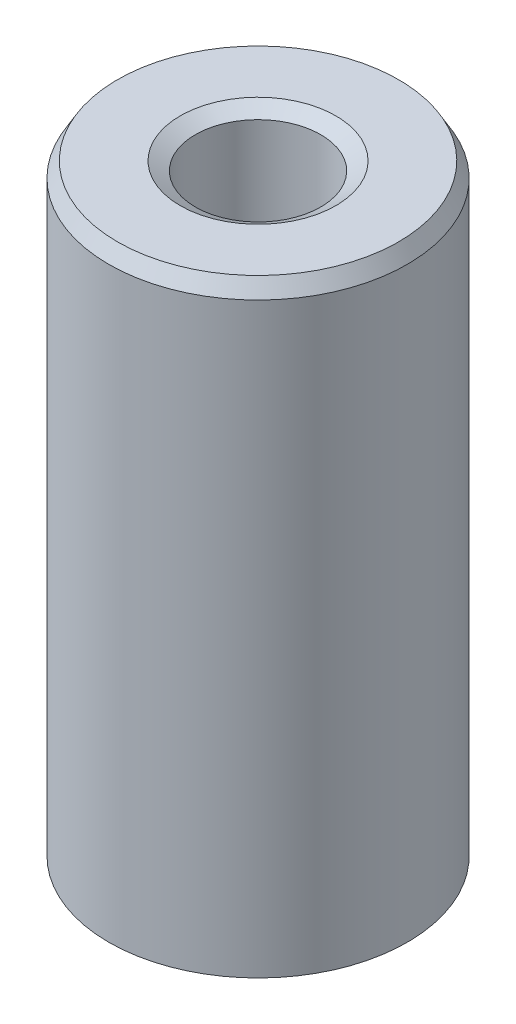
ISO-10303-21;
HEADER;
FILE_DESCRIPTION(('STEP AP214'),'2;1');
FILE_NAME('part.step','',(''),(''),'','','');
FILE_SCHEMA(('AUTOMOTIVE_DESIGN { 1 0 10303 214 1 1 1 1 }'));
ENDSEC;
DATA;
#1=APPLICATION_CONTEXT('core data for automotive mechanical design processes');
#2=APPLICATION_PROTOCOL_DEFINITION('international standard','automotive_design',2000,#1);
#3=PRODUCT_CONTEXT('',#1,'mechanical');
#4=PRODUCT('Part','Part','',(#3));
#5=PRODUCT_RELATED_PRODUCT_CATEGORY('part','',(#4));
#6=PRODUCT_DEFINITION_FORMATION('','',#4);
#7=PRODUCT_DEFINITION_CONTEXT('part definition',#1,'design');
#8=PRODUCT_DEFINITION('design','',#6,#7);
#9=PRODUCT_DEFINITION_SHAPE('','',#8);
#10=(LENGTH_UNIT() NAMED_UNIT(*) SI_UNIT(.MILLI.,.METRE.));
#11=(NAMED_UNIT(*) PLANE_ANGLE_UNIT() SI_UNIT($,.RADIAN.));
#12=(NAMED_UNIT(*) SI_UNIT($,.STERADIAN.) SOLID_ANGLE_UNIT());
#13=UNCERTAINTY_MEASURE_WITH_UNIT(LENGTH_MEASURE(1.E-05),#10,'distance_accuracy_value','');
#14=(GEOMETRIC_REPRESENTATION_CONTEXT(3) GLOBAL_UNCERTAINTY_ASSIGNED_CONTEXT((#13)) GLOBAL_UNIT_ASSIGNED_CONTEXT((#10,
#11,#12)) REPRESENTATION_CONTEXT('',''));
#15=CARTESIAN_POINT('',(0.,0.,0.));
#16=DIRECTION('',(0.,0.,1.));
#17=DIRECTION('',(1.,0.,0.));
#18=AXIS2_PLACEMENT_3D('',#15,#16,#17);
#19=CARTESIAN_POINT('',(0.,153.48570359672,0.));
#20=DIRECTION('',(0.,-1.,0.));
#21=DIRECTION('',(0.,0.,-1.));
#22=AXIS2_PLACEMENT_3D('',#19,#20,#21);
#23=CYLINDRICAL_SURFACE('',#22,37.5);
#24=CARTESIAN_POINT('',(0.,2.19219811870883,0.));
#25=DIRECTION('',(0.,1.,0.));
#26=DIRECTION('',(0.,0.,1.));
#27=AXIS2_PLACEMENT_3D('',#24,#25,#26);
#28=CIRCLE('',#27,37.5);
#29=CARTESIAN_POINT('',(0.,2.19219811870883,37.5));
#30=VERTEX_POINT('',#29);
#31=EDGE_CURVE('E10',#30,#30,#28,.T.);
#32=ORIENTED_EDGE('',*,*,#31,.T.);
#33=EDGE_LOOP('',(#32));
#34=FACE_BOUND('',#33,.T.);
#35=CARTESIAN_POINT('',(0.,149.68870507486,0.));
#36=DIRECTION('',(0.,1.,0.));
#37=DIRECTION('',(0.,0.,1.));
#38=AXIS2_PLACEMENT_3D('',#35,#36,#37);
#39=CIRCLE('',#38,37.5);
#40=CARTESIAN_POINT('',(0.,149.68870507486,37.5));
#41=VERTEX_POINT('',#40);
#42=EDGE_CURVE('E50',#41,#41,#39,.F.);
#43=ORIENTED_EDGE('',*,*,#42,.T.);
#44=EDGE_LOOP('',(#43));
#45=FACE_BOUND('',#44,.T.);
#46=ADVANCED_FACE('F39',(#34,#45),#23,.T.);
#47=CARTESIAN_POINT('',(0.,153.48570359672,0.));
#48=DIRECTION('',(0.,1.,0.));
#49=DIRECTION('',(0.,0.,1.));
#50=AXIS2_PLACEMENT_3D('',#47,#48,#49);
#51=PLANE('',#50);
#52=CARTESIAN_POINT('',(0.,153.48570359672,0.));
#53=DIRECTION('',(0.,1.,0.));
#54=DIRECTION('',(0.,0.,1.));
#55=AXIS2_PLACEMENT_3D('',#52,#53,#54);
#56=CIRCLE('',#55,19.5526898251311);
#57=CARTESIAN_POINT('',(0.,153.48570359672,19.5526898251311));
#58=VERTEX_POINT('',#57);
#59=EDGE_CURVE('E58',#58,#58,#56,.F.);
#60=ORIENTED_EDGE('',*,*,#59,.T.);
#61=EDGE_LOOP('',(#60));
#62=FACE_BOUND('',#61,.T.);
#63=CARTESIAN_POINT('',(0.,153.48570359672,0.));
#64=DIRECTION('',(0.,1.,0.));
#65=DIRECTION('',(0.,0.,1.));
#66=AXIS2_PLACEMENT_3D('',#63,#64,#65);
#67=CIRCLE('',#66,35.3078018812912);
#68=CARTESIAN_POINT('',(0.,153.48570359672,35.3078018812912));
#69=VERTEX_POINT('',#68);
#70=EDGE_CURVE('E61',#69,#69,#67,.T.);
#71=ORIENTED_EDGE('',*,*,#70,.T.);
#72=EDGE_LOOP('',(#71));
#73=FACE_BOUND('',#72,.T.);
#74=ADVANCED_FACE('F88',(#62,#73),#51,.T.);
#75=CARTESIAN_POINT('',(0.,0.,0.));
#76=DIRECTION('',(0.,1.,0.));
#77=DIRECTION('',(0.,0.,1.));
#78=AXIS2_PLACEMENT_3D('',#75,#76,#77);
#79=PLANE('',#78);
#80=CARTESIAN_POINT('',(0.,0.,0.));
#81=DIRECTION('',(0.,1.,0.));
#82=DIRECTION('',(0.,0.,1.));
#83=AXIS2_PLACEMENT_3D('',#80,#81,#82);
#84=CIRCLE('',#83,17.9478894219793);
#85=CARTESIAN_POINT('',(0.,0.,17.9478894219793));
#86=VERTEX_POINT('',#85);
#87=EDGE_CURVE('E51',#86,#86,#84,.T.);
#88=ORIENTED_EDGE('',*,*,#87,.T.);
#89=EDGE_LOOP('',(#88));
#90=FACE_BOUND('',#89,.T.);
#91=CARTESIAN_POINT('',(0.,0.,0.));
#92=DIRECTION('',(0.,1.,0.));
#93=DIRECTION('',(0.,0.,1.));
#94=AXIS2_PLACEMENT_3D('',#91,#92,#93);
#95=CIRCLE('',#94,33.7030014781394);
#96=CARTESIAN_POINT('',(0.,0.,33.7030014781394));
#97=VERTEX_POINT('',#96);
#98=EDGE_CURVE('E54',#97,#97,#95,.F.);
#99=ORIENTED_EDGE('',*,*,#98,.T.);
#100=EDGE_LOOP('',(#99));
#101=FACE_BOUND('',#100,.T.);
#102=ADVANCED_FACE('F83',(#90,#101),#79,.F.);
#103=CARTESIAN_POINT('',(0.,153.48570359672,0.));
#104=DIRECTION('',(0.,-1.,0.));
#105=DIRECTION('',(0.,0.,-1.));
#106=AXIS2_PLACEMENT_3D('',#103,#104,#105);
#107=CYLINDRICAL_SURFACE('',#106,15.7556913032705);
#108=CARTESIAN_POINT('',(0.,151.293505478012,0.));
#109=DIRECTION('',(0.,1.,0.));
#110=DIRECTION('',(0.,0.,1.));
#111=AXIS2_PLACEMENT_3D('',#108,#109,#110);
#112=CIRCLE('',#111,15.7556913032705);
#113=CARTESIAN_POINT('',(0.,151.293505478012,15.7556913032705));
#114=VERTEX_POINT('',#113);
#115=EDGE_CURVE('E67',#114,#114,#112,.T.);
#116=ORIENTED_EDGE('',*,*,#115,.T.);
#117=EDGE_LOOP('',(#116));
#118=FACE_BOUND('',#117,.T.);
#119=CARTESIAN_POINT('',(0.,3.79699852186058,0.));
#120=DIRECTION('',(0.,1.,0.));
#121=DIRECTION('',(0.,0.,1.));
#122=AXIS2_PLACEMENT_3D('',#119,#120,#121);
#123=CIRCLE('',#122,15.7556913032705);
#124=CARTESIAN_POINT('',(0.,3.79699852186058,15.7556913032705));
#125=VERTEX_POINT('',#124);
#126=EDGE_CURVE('E69',#125,#125,#123,.F.);
#127=ORIENTED_EDGE('',*,*,#126,.T.);
#128=EDGE_LOOP('',(#127));
#129=FACE_BOUND('',#128,.T.);
#130=ADVANCED_FACE('F71',(#118,#129),#107,.F.);
#131=CARTESIAN_POINT('',(0.,151.293505478012,0.));
#132=DIRECTION('',(0.,1.,0.));
#133=DIRECTION('',(0.,0.,1.));
#134=AXIS2_PLACEMENT_3D('',#131,#132,#133);
#135=CONICAL_SURFACE('',#134,15.7556913032705,1.0471975511966);
#136=ORIENTED_EDGE('',*,*,#59,.F.);
#137=EDGE_LOOP('',(#136));
#138=FACE_BOUND('',#137,.T.);
#139=ORIENTED_EDGE('',*,*,#115,.F.);
#140=EDGE_LOOP('',(#139));
#141=FACE_BOUND('',#140,.T.);
#142=ADVANCED_FACE('F77',(#138,#141),#135,.F.);
#143=CARTESIAN_POINT('',(0.,0.,0.));
#144=DIRECTION('',(0.,-1.,0.));
#145=DIRECTION('',(0.,0.,-1.));
#146=AXIS2_PLACEMENT_3D('',#143,#144,#145);
#147=CONICAL_SURFACE('',#146,17.9478894219793,0.523598775598297);
#148=ORIENTED_EDGE('',*,*,#126,.F.);
#149=EDGE_LOOP('',(#148));
#150=FACE_BOUND('',#149,.T.);
#151=ORIENTED_EDGE('',*,*,#87,.F.);
#152=EDGE_LOOP('',(#151));
#153=FACE_BOUND('',#152,.T.);
#154=ADVANCED_FACE('F73',(#150,#153),#147,.F.);
#155=CARTESIAN_POINT('',(0.,2.19219811870883,0.));
#156=DIRECTION('',(0.,1.,0.));
#157=DIRECTION('',(0.,0.,1.));
#158=AXIS2_PLACEMENT_3D('',#155,#156,#157);
#159=CONICAL_SURFACE('',#158,37.5,1.0471975511966);
#160=ORIENTED_EDGE('',*,*,#98,.F.);
#161=EDGE_LOOP('',(#160));
#162=FACE_BOUND('',#161,.T.);
#163=ORIENTED_EDGE('',*,*,#31,.F.);
#164=EDGE_LOOP('',(#163));
#165=FACE_BOUND('',#164,.T.);
#166=ADVANCED_FACE('F76',(#162,#165),#159,.T.);
#167=CARTESIAN_POINT('',(0.,153.48570359672,0.));
#168=DIRECTION('',(0.,-1.,0.));
#169=DIRECTION('',(0.,0.,-1.));
#170=AXIS2_PLACEMENT_3D('',#167,#168,#169);
#171=CONICAL_SURFACE('',#170,35.3078018812912,0.523598775598293);
#172=ORIENTED_EDGE('',*,*,#42,.F.);
#173=EDGE_LOOP('',(#172));
#174=FACE_BOUND('',#173,.T.);
#175=ORIENTED_EDGE('',*,*,#70,.F.);
#176=EDGE_LOOP('',(#175));
#177=FACE_BOUND('',#176,.T.);
#178=ADVANCED_FACE('F45',(#174,#177),#171,.T.);
#179=CLOSED_SHELL('',(#46,#74,#102,#130,#142,#154,#166,#178));
#180=MANIFOLD_SOLID_BREP('B2',#179);
#181=ADVANCED_BREP_SHAPE_REPRESENTATION('',(#18,#180),#14);
#182=SHAPE_DEFINITION_REPRESENTATION(#9,#181);
ENDSEC;
END-ISO-10303-21;
